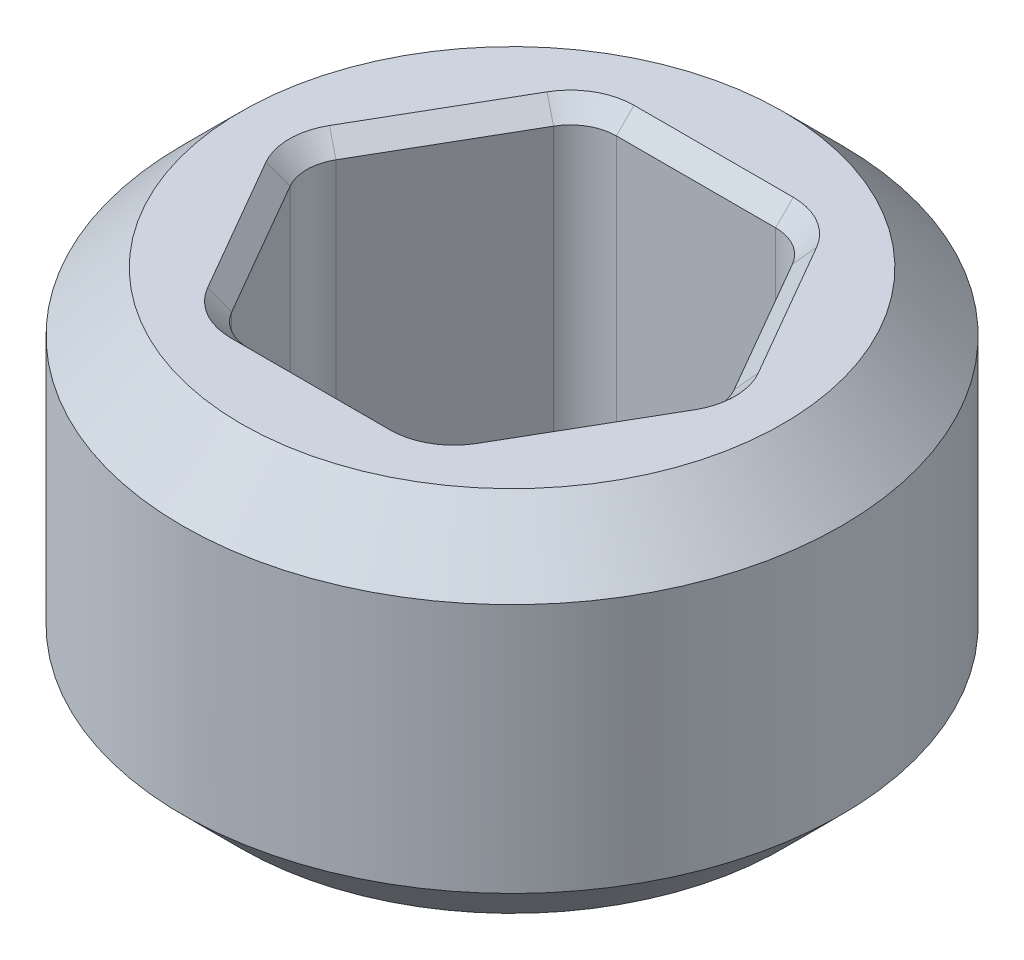
ISO-10303-21;
HEADER;
FILE_DESCRIPTION(('STEP AP214'),'2;1');
FILE_NAME('part.step','',(''),(''),'','','');
FILE_SCHEMA(('AUTOMOTIVE_DESIGN { 1 0 10303 214 1 1 1 1 }'));
ENDSEC;
DATA;
#1=APPLICATION_CONTEXT('core data for automotive mechanical design processes');
#2=APPLICATION_PROTOCOL_DEFINITION('international standard','automotive_design',2000,#1);
#3=PRODUCT_CONTEXT('',#1,'mechanical');
#4=PRODUCT('Part','Part','',(#3));
#5=PRODUCT_RELATED_PRODUCT_CATEGORY('part','',(#4));
#6=PRODUCT_DEFINITION_FORMATION('','',#4);
#7=PRODUCT_DEFINITION_CONTEXT('part definition',#1,'design');
#8=PRODUCT_DEFINITION('design','',#6,#7);
#9=PRODUCT_DEFINITION_SHAPE('','',#8);
#10=(LENGTH_UNIT() NAMED_UNIT(*) SI_UNIT(.MILLI.,.METRE.));
#11=(NAMED_UNIT(*) PLANE_ANGLE_UNIT() SI_UNIT($,.RADIAN.));
#12=(NAMED_UNIT(*) SI_UNIT($,.STERADIAN.) SOLID_ANGLE_UNIT());
#13=UNCERTAINTY_MEASURE_WITH_UNIT(LENGTH_MEASURE(1.E-05),#10,'distance_accuracy_value','');
#14=(GEOMETRIC_REPRESENTATION_CONTEXT(3) GLOBAL_UNCERTAINTY_ASSIGNED_CONTEXT((#13)) GLOBAL_UNIT_ASSIGNED_CONTEXT((#10,
#11,#12)) REPRESENTATION_CONTEXT('',''));
#15=CARTESIAN_POINT('',(0.,0.,0.));
#16=DIRECTION('',(0.,0.,1.));
#17=DIRECTION('',(1.,0.,0.));
#18=AXIS2_PLACEMENT_3D('',#15,#16,#17);
#19=CARTESIAN_POINT('',(0.,-0.79375,0.));
#20=DIRECTION('',(0.,-1.,0.));
#21=DIRECTION('',(0.,0.,-1.));
#22=AXIS2_PLACEMENT_3D('',#19,#20,#21);
#23=PLANE('',#22);
#24=CARTESIAN_POINT('',(0.343703832126949,-0.79375,0.5953125));
#25=DIRECTION('',(0.,-1.,0.));
#26=DIRECTION('',(0.,0.,-1.));
#27=AXIS2_PLACEMENT_3D('',#24,#25,#26);
#28=CIRCLE('',#27,0.2746375);
#29=CARTESIAN_POINT('',(0.343703832126949,-0.79375,0.86995));
#30=VERTEX_POINT('',#29);
#31=CARTESIAN_POINT('',(0.581546883958798,-0.79375,0.73263125));
#32=VERTEX_POINT('',#31);
#33=EDGE_CURVE('E430',#30,#32,#28,.F.);
#34=ORIENTED_EDGE('',*,*,#33,.T.);
#35=DIRECTION('',(0.499999999999999,0.,-0.866025403784439));
#36=VECTOR('',#35,1.);
#37=CARTESIAN_POINT('',(0.925250716085747,-0.79375,0.137318749999999));
#38=LINE('',#37,#36);
#39=CARTESIAN_POINT('',(0.925250716085747,-0.79375,0.137318749999999));
#40=VERTEX_POINT('',#39);
#41=EDGE_CURVE('E434',#32,#40,#38,.T.);
#42=ORIENTED_EDGE('',*,*,#41,.T.);
#43=CARTESIAN_POINT('',(0.687407664253898,-0.79375,0.));
#44=DIRECTION('',(0.,-1.,0.));
#45=DIRECTION('',(0.,0.,-1.));
#46=AXIS2_PLACEMENT_3D('',#43,#44,#45);
#47=CIRCLE('',#46,0.2746375);
#48=CARTESIAN_POINT('',(0.925250716085747,-0.79375,-0.137318750000001));
#49=VERTEX_POINT('',#48);
#50=EDGE_CURVE('E432',#40,#49,#47,.F.);
#51=ORIENTED_EDGE('',*,*,#50,.T.);
#52=DIRECTION('',(-0.5,0.,-0.866025403784439));
#53=VECTOR('',#52,1.);
#54=CARTESIAN_POINT('',(0.581546883958798,-0.79375,-0.73263125));
#55=LINE('',#54,#53);
#56=CARTESIAN_POINT('',(0.581546883958798,-0.79375,-0.73263125));
#57=VERTEX_POINT('',#56);
#58=EDGE_CURVE('E428',#49,#57,#55,.T.);
#59=ORIENTED_EDGE('',*,*,#58,.T.);
#60=CARTESIAN_POINT('',(0.343703832126949,-0.79375,-0.5953125));
#61=DIRECTION('',(0.,-1.,0.));
#62=DIRECTION('',(0.,0.,-1.));
#63=AXIS2_PLACEMENT_3D('',#60,#61,#62);
#64=CIRCLE('',#63,0.2746375);
#65=CARTESIAN_POINT('',(0.343703832126949,-0.79375,-0.86995));
#66=VERTEX_POINT('',#65);
#67=EDGE_CURVE('E420',#57,#66,#64,.F.);
#68=ORIENTED_EDGE('',*,*,#67,.T.);
#69=DIRECTION('',(-1.,0.,0.));
#70=VECTOR('',#69,1.);
#71=CARTESIAN_POINT('',(-0.343703832126949,-0.79375,-0.86995));
#72=LINE('',#71,#70);
#73=CARTESIAN_POINT('',(-0.343703832126949,-0.79375,-0.86995));
#74=VERTEX_POINT('',#73);
#75=EDGE_CURVE('E202',#66,#74,#72,.T.);
#76=ORIENTED_EDGE('',*,*,#75,.T.);
#77=CARTESIAN_POINT('',(-0.343703832126949,-0.79375,-0.5953125));
#78=DIRECTION('',(0.,-1.,0.));
#79=DIRECTION('',(0.,0.,-1.));
#80=AXIS2_PLACEMENT_3D('',#77,#78,#79);
#81=CIRCLE('',#80,0.2746375);
#82=CARTESIAN_POINT('',(-0.581546883958798,-0.79375,-0.73263125));
#83=VERTEX_POINT('',#82);
#84=EDGE_CURVE('E196',#74,#83,#81,.F.);
#85=ORIENTED_EDGE('',*,*,#84,.T.);
#86=DIRECTION('',(-0.499999999999999,0.,0.866025403784439));
#87=VECTOR('',#86,1.);
#88=CARTESIAN_POINT('',(-0.925250716085747,-0.79375,-0.137318749999999));
#89=LINE('',#88,#87);
#90=CARTESIAN_POINT('',(-0.925250716085747,-0.79375,-0.137318749999999));
#91=VERTEX_POINT('',#90);
#92=EDGE_CURVE('E199',#83,#91,#89,.T.);
#93=ORIENTED_EDGE('',*,*,#92,.T.);
#94=CARTESIAN_POINT('',(-0.687407664253898,-0.79375,0.));
#95=DIRECTION('',(0.,-1.,0.));
#96=DIRECTION('',(0.,0.,-1.));
#97=AXIS2_PLACEMENT_3D('',#94,#95,#96);
#98=CIRCLE('',#97,0.2746375);
#99=CARTESIAN_POINT('',(-0.925250716085747,-0.79375,0.137318750000001));
#100=VERTEX_POINT('',#99);
#101=EDGE_CURVE('E208',#91,#100,#98,.F.);
#102=ORIENTED_EDGE('',*,*,#101,.T.);
#103=DIRECTION('',(0.500000000000001,0.,0.866025403784438));
#104=VECTOR('',#103,1.);
#105=CARTESIAN_POINT('',(-0.581546883958797,-0.79375,0.732631250000001));
#106=LINE('',#105,#104);
#107=CARTESIAN_POINT('',(-0.581546883958797,-0.79375,0.73263125));
#108=VERTEX_POINT('',#107);
#109=EDGE_CURVE('E207',#100,#108,#106,.T.);
#110=ORIENTED_EDGE('',*,*,#109,.T.);
#111=CARTESIAN_POINT('',(-0.343703832126948,-0.79375,0.5953125));
#112=DIRECTION('',(0.,-1.,0.));
#113=DIRECTION('',(0.,0.,-1.));
#114=AXIS2_PLACEMENT_3D('',#111,#112,#113);
#115=CIRCLE('',#114,0.2746375);
#116=CARTESIAN_POINT('',(-0.343703832126948,-0.79375,0.86995));
#117=VERTEX_POINT('',#116);
#118=EDGE_CURVE('E418',#108,#117,#115,.F.);
#119=ORIENTED_EDGE('',*,*,#118,.T.);
#120=DIRECTION('',(1.,0.,0.));
#121=VECTOR('',#120,1.);
#122=CARTESIAN_POINT('',(0.343703832126949,-0.79375,0.86995));
#123=LINE('',#122,#121);
#124=EDGE_CURVE('E422',#117,#30,#123,.T.);
#125=ORIENTED_EDGE('',*,*,#124,.T.);
#126=EDGE_LOOP('',(#34,#42,#51,#59,#68,#76,#85,#93,#102,#110,#119,#125));
#127=FACE_BOUND('',#126,.T.);
#128=CARTESIAN_POINT('',(0.,-0.79375,0.));
#129=DIRECTION('',(0.,-1.,0.));
#130=DIRECTION('',(0.,0.,-1.));
#131=AXIS2_PLACEMENT_3D('',#128,#129,#130);
#132=CIRCLE('',#131,1.1684);
#133=CARTESIAN_POINT('',(0.,-0.79375,-1.1684));
#134=VERTEX_POINT('',#133);
#135=EDGE_CURVE('E464',#134,#134,#132,.T.);
#136=ORIENTED_EDGE('',*,*,#135,.T.);
#137=EDGE_LOOP('',(#136));
#138=FACE_BOUND('',#137,.T.);
#139=ADVANCED_FACE('F34',(#127,#138),#23,.T.);
#140=CARTESIAN_POINT('',(0.,-1.70416602917091,0.));
#141=DIRECTION('',(0.,-1.,0.));
#142=DIRECTION('',(0.,0.,-1.));
#143=AXIS2_PLACEMENT_3D('',#140,#141,#142);
#144=CYLINDRICAL_SURFACE('',#143,1.4224);
#145=CARTESIAN_POINT('',(0.,-0.539749999999999,0.));
#146=DIRECTION('',(0.,-1.,0.));
#147=DIRECTION('',(0.,0.,-1.));
#148=AXIS2_PLACEMENT_3D('',#145,#146,#147);
#149=CIRCLE('',#148,1.4224);
#150=CARTESIAN_POINT('',(0.,-0.539749999999999,-1.4224));
#151=VERTEX_POINT('',#150);
#152=EDGE_CURVE('E470',#151,#151,#149,.F.);
#153=ORIENTED_EDGE('',*,*,#152,.T.);
#154=EDGE_LOOP('',(#153));
#155=FACE_BOUND('',#154,.T.);
#156=CARTESIAN_POINT('',(0.,0.53975,0.));
#157=DIRECTION('',(0.,1.,0.));
#158=DIRECTION('',(0.,0.,1.));
#159=AXIS2_PLACEMENT_3D('',#156,#157,#158);
#160=CIRCLE('',#159,1.4224);
#161=CARTESIAN_POINT('',(0.,0.53975,1.4224));
#162=VERTEX_POINT('',#161);
#163=EDGE_CURVE('E467',#162,#162,#160,.F.);
#164=ORIENTED_EDGE('',*,*,#163,.T.);
#165=EDGE_LOOP('',(#164));
#166=FACE_BOUND('',#165,.T.);
#167=ADVANCED_FACE('F553',(#155,#166),#144,.T.);
#168=CARTESIAN_POINT('',(1.4224,0.79375,0.));
#169=DIRECTION('',(0.,1.,0.));
#170=DIRECTION('',(0.,0.,1.));
#171=AXIS2_PLACEMENT_3D('',#168,#169,#170);
#172=PLANE('',#171);
#173=CARTESIAN_POINT('',(0.343703832126949,0.79375,-0.5953125));
#174=DIRECTION('',(0.,1.,0.));
#175=DIRECTION('',(0.,0.,1.));
#176=AXIS2_PLACEMENT_3D('',#173,#174,#175);
#177=CIRCLE('',#176,0.2746375);
#178=CARTESIAN_POINT('',(0.343703832126949,0.79375,-0.86995));
#179=VERTEX_POINT('',#178);
#180=CARTESIAN_POINT('',(0.581546883958798,0.79375,-0.73263125));
#181=VERTEX_POINT('',#180);
#182=EDGE_CURVE('E43',#179,#181,#177,.F.);
#183=ORIENTED_EDGE('',*,*,#182,.T.);
#184=DIRECTION('',(0.5,0.,0.866025403784439));
#185=VECTOR('',#184,1.);
#186=CARTESIAN_POINT('',(0.925250716085747,0.79375,-0.137318750000001));
#187=LINE('',#186,#185);
#188=CARTESIAN_POINT('',(0.925250716085747,0.79375,-0.137318750000001));
#189=VERTEX_POINT('',#188);
#190=EDGE_CURVE('E11',#181,#189,#187,.T.);
#191=ORIENTED_EDGE('',*,*,#190,.T.);
#192=CARTESIAN_POINT('',(0.687407664253898,0.79375,0.));
#193=DIRECTION('',(0.,1.,0.));
#194=DIRECTION('',(0.,0.,1.));
#195=AXIS2_PLACEMENT_3D('',#192,#193,#194);
#196=CIRCLE('',#195,0.2746375);
#197=CARTESIAN_POINT('',(0.925250716085747,0.79375,0.137318749999999));
#198=VERTEX_POINT('',#197);
#199=EDGE_CURVE('E346',#189,#198,#196,.F.);
#200=ORIENTED_EDGE('',*,*,#199,.T.);
#201=DIRECTION('',(-0.499999999999999,0.,0.866025403784439));
#202=VECTOR('',#201,1.);
#203=CARTESIAN_POINT('',(0.581546883958798,0.79375,0.73263125));
#204=LINE('',#203,#202);
#205=CARTESIAN_POINT('',(0.581546883958798,0.79375,0.73263125));
#206=VERTEX_POINT('',#205);
#207=EDGE_CURVE('E342',#198,#206,#204,.T.);
#208=ORIENTED_EDGE('',*,*,#207,.T.);
#209=CARTESIAN_POINT('',(0.343703832126949,0.79375,0.5953125));
#210=DIRECTION('',(0.,1.,0.));
#211=DIRECTION('',(0.,0.,1.));
#212=AXIS2_PLACEMENT_3D('',#209,#210,#211);
#213=CIRCLE('',#212,0.2746375);
#214=CARTESIAN_POINT('',(0.343703832126949,0.79375,0.86995));
#215=VERTEX_POINT('',#214);
#216=EDGE_CURVE('E338',#206,#215,#213,.F.);
#217=ORIENTED_EDGE('',*,*,#216,.T.);
#218=DIRECTION('',(-1.,0.,0.));
#219=VECTOR('',#218,1.);
#220=CARTESIAN_POINT('',(-0.343703832126948,0.79375,0.86995));
#221=LINE('',#220,#219);
#222=CARTESIAN_POINT('',(-0.343703832126948,0.79375,0.86995));
#223=VERTEX_POINT('',#222);
#224=EDGE_CURVE('E334',#215,#223,#221,.T.);
#225=ORIENTED_EDGE('',*,*,#224,.T.);
#226=CARTESIAN_POINT('',(-0.343703832126948,0.79375,0.5953125));
#227=DIRECTION('',(0.,1.,0.));
#228=DIRECTION('',(0.,0.,1.));
#229=AXIS2_PLACEMENT_3D('',#226,#227,#228);
#230=CIRCLE('',#229,0.2746375);
#231=CARTESIAN_POINT('',(-0.581546883958798,0.79375,0.73263125));
#232=VERTEX_POINT('',#231);
#233=EDGE_CURVE('E330',#223,#232,#230,.F.);
#234=ORIENTED_EDGE('',*,*,#233,.T.);
#235=DIRECTION('',(-0.500000000000001,0.,-0.866025403784438));
#236=VECTOR('',#235,1.);
#237=CARTESIAN_POINT('',(-0.925250716085747,0.79375,0.137318750000001));
#238=LINE('',#237,#236);
#239=CARTESIAN_POINT('',(-0.925250716085747,0.79375,0.137318750000001));
#240=VERTEX_POINT('',#239);
#241=EDGE_CURVE('E328',#232,#240,#238,.T.);
#242=ORIENTED_EDGE('',*,*,#241,.T.);
#243=CARTESIAN_POINT('',(-0.687407664253898,0.79375,0.));
#244=DIRECTION('',(0.,1.,0.));
#245=DIRECTION('',(0.,0.,1.));
#246=AXIS2_PLACEMENT_3D('',#243,#244,#245);
#247=CIRCLE('',#246,0.2746375);
#248=CARTESIAN_POINT('',(-0.925250716085747,0.79375,-0.13731875));
#249=VERTEX_POINT('',#248);
#250=EDGE_CURVE('E332',#240,#249,#247,.F.);
#251=ORIENTED_EDGE('',*,*,#250,.T.);
#252=DIRECTION('',(0.499999999999999,0.,-0.866025403784439));
#253=VECTOR('',#252,1.);
#254=CARTESIAN_POINT('',(-0.581546883958799,0.79375,-0.73263125));
#255=LINE('',#254,#253);
#256=CARTESIAN_POINT('',(-0.581546883958799,0.79375,-0.73263125));
#257=VERTEX_POINT('',#256);
#258=EDGE_CURVE('E336',#249,#257,#255,.T.);
#259=ORIENTED_EDGE('',*,*,#258,.T.);
#260=CARTESIAN_POINT('',(-0.343703832126949,0.79375,-0.5953125));
#261=DIRECTION('',(0.,1.,0.));
#262=DIRECTION('',(0.,0.,1.));
#263=AXIS2_PLACEMENT_3D('',#260,#261,#262);
#264=CIRCLE('',#263,0.2746375);
#265=CARTESIAN_POINT('',(-0.343703832126949,0.79375,-0.86995));
#266=VERTEX_POINT('',#265);
#267=EDGE_CURVE('E340',#257,#266,#264,.F.);
#268=ORIENTED_EDGE('',*,*,#267,.T.);
#269=DIRECTION('',(1.,0.,0.));
#270=VECTOR('',#269,1.);
#271=CARTESIAN_POINT('',(0.343703832126949,0.79375,-0.86995));
#272=LINE('',#271,#270);
#273=EDGE_CURVE('E344',#266,#179,#272,.T.);
#274=ORIENTED_EDGE('',*,*,#273,.T.);
#275=EDGE_LOOP('',(#183,#191,#200,#208,#217,#225,#234,#242,#251,#259,#268,#274));
#276=FACE_BOUND('',#275,.T.);
#277=CARTESIAN_POINT('',(0.,0.79375,0.));
#278=DIRECTION('',(0.,1.,0.));
#279=DIRECTION('',(0.,0.,1.));
#280=AXIS2_PLACEMENT_3D('',#277,#278,#279);
#281=CIRCLE('',#280,1.1684);
#282=CARTESIAN_POINT('',(0.,0.79375,1.1684));
#283=VERTEX_POINT('',#282);
#284=EDGE_CURVE('E219',#283,#283,#281,.T.);
#285=ORIENTED_EDGE('',*,*,#284,.T.);
#286=EDGE_LOOP('',(#285));
#287=FACE_BOUND('',#286,.T.);
#288=ADVANCED_FACE('F348',(#276,#287),#172,.T.);
#289=CARTESIAN_POINT('',(0.91654355233853,-0.79375,0.));
#290=DIRECTION('',(0.866025403784438,0.,-0.5));
#291=DIRECTION('',(-0.5,0.,-0.866025403784439));
#292=AXIS2_PLACEMENT_3D('',#289,#290,#291);
#293=PLANE('',#292);
#294=DIRECTION('',(0.,1.,0.));
#295=VECTOR('',#294,1.);
#296=CARTESIAN_POINT('',(0.515555748190423,-0.79375,-0.69453125));
#297=LINE('',#296,#295);
#298=CARTESIAN_POINT('',(0.515555748190423,0.71755,-0.69453125));
#299=VERTEX_POINT('',#298);
#300=CARTESIAN_POINT('',(0.515555748190423,-0.71755,-0.69453125));
#301=VERTEX_POINT('',#300);
#302=EDGE_CURVE('E225',#299,#301,#297,.F.);
#303=ORIENTED_EDGE('',*,*,#302,.T.);
#304=DIRECTION('',(0.5,0.,0.866025403784439));
#305=VECTOR('',#304,1.);
#306=CARTESIAN_POINT('',(0.859259580317372,-0.71755,-0.0992187500000007));
#307=LINE('',#306,#305);
#308=CARTESIAN_POINT('',(0.859259580317372,-0.71755,-0.0992187500000007));
#309=VERTEX_POINT('',#308);
#310=EDGE_CURVE('E380',#301,#309,#307,.T.);
#311=ORIENTED_EDGE('',*,*,#310,.T.);
#312=DIRECTION('',(0.,1.,0.));
#313=VECTOR('',#312,1.);
#314=CARTESIAN_POINT('',(0.859259580317372,0.79375,-0.0992187500000007));
#315=LINE('',#314,#313);
#316=CARTESIAN_POINT('',(0.859259580317372,0.71755,-0.0992187500000007));
#317=VERTEX_POINT('',#316);
#318=EDGE_CURVE('E448',#309,#317,#315,.T.);
#319=ORIENTED_EDGE('',*,*,#318,.T.);
#320=DIRECTION('',(-0.5,0.,-0.866025403784439));
#321=VECTOR('',#320,1.);
#322=CARTESIAN_POINT('',(0.515555748190423,0.71755,-0.69453125));
#323=LINE('',#322,#321);
#324=EDGE_CURVE('E377',#317,#299,#323,.T.);
#325=ORIENTED_EDGE('',*,*,#324,.T.);
#326=EDGE_LOOP('',(#303,#311,#319,#325));
#327=FACE_BOUND('',#326,.T.);
#328=ADVANCED_FACE('F532',(#327),#293,.F.);
#329=CARTESIAN_POINT('',(0.458271776169266,-0.79375,0.79375));
#330=DIRECTION('',(0.866025403784439,0.,0.499999999999999));
#331=DIRECTION('',(0.499999999999999,0.,-0.866025403784439));
#332=AXIS2_PLACEMENT_3D('',#329,#330,#331);
#333=PLANE('',#332);
#334=DIRECTION('',(0.,1.,0.));
#335=VECTOR('',#334,1.);
#336=CARTESIAN_POINT('',(0.859259580317372,-0.79375,0.0992187499999992));
#337=LINE('',#336,#335);
#338=CARTESIAN_POINT('',(0.859259580317372,0.71755,0.0992187499999992));
#339=VERTEX_POINT('',#338);
#340=CARTESIAN_POINT('',(0.859259580317372,-0.71755,0.0992187499999992));
#341=VERTEX_POINT('',#340);
#342=EDGE_CURVE('E440',#339,#341,#337,.F.);
#343=ORIENTED_EDGE('',*,*,#342,.T.);
#344=DIRECTION('',(-0.499999999999999,0.,0.866025403784439));
#345=VECTOR('',#344,1.);
#346=CARTESIAN_POINT('',(0.515555748190424,-0.71755,0.69453125));
#347=LINE('',#346,#345);
#348=CARTESIAN_POINT('',(0.515555748190424,-0.71755,0.69453125));
#349=VERTEX_POINT('',#348);
#350=EDGE_CURVE('E365',#341,#349,#347,.T.);
#351=ORIENTED_EDGE('',*,*,#350,.T.);
#352=DIRECTION('',(0.,1.,0.));
#353=VECTOR('',#352,1.);
#354=CARTESIAN_POINT('',(0.515555748190424,0.79375,0.69453125));
#355=LINE('',#354,#353);
#356=CARTESIAN_POINT('',(0.515555748190424,0.71755,0.69453125));
#357=VERTEX_POINT('',#356);
#358=EDGE_CURVE('E442',#349,#357,#355,.T.);
#359=ORIENTED_EDGE('',*,*,#358,.T.);
#360=DIRECTION('',(0.499999999999999,0.,-0.866025403784439));
#361=VECTOR('',#360,1.);
#362=CARTESIAN_POINT('',(0.859259580317372,0.71755,0.0992187499999991));
#363=LINE('',#362,#361);
#364=EDGE_CURVE('E370',#357,#339,#363,.T.);
#365=ORIENTED_EDGE('',*,*,#364,.T.);
#366=EDGE_LOOP('',(#343,#351,#359,#365));
#367=FACE_BOUND('',#366,.T.);
#368=ADVANCED_FACE('F439',(#367),#333,.F.);
#369=CARTESIAN_POINT('',(-0.458271776169265,-0.79375,0.79375));
#370=DIRECTION('',(0.,0.,1.));
#371=DIRECTION('',(1.,0.,0.));
#372=AXIS2_PLACEMENT_3D('',#369,#370,#371);
#373=PLANE('',#372);
#374=DIRECTION('',(0.,1.,0.));
#375=VECTOR('',#374,1.);
#376=CARTESIAN_POINT('',(0.343703832126949,-0.79375,0.79375));
#377=LINE('',#376,#375);
#378=CARTESIAN_POINT('',(0.343703832126949,0.71755,0.79375));
#379=VERTEX_POINT('',#378);
#380=CARTESIAN_POINT('',(0.343703832126949,-0.71755,0.79375));
#381=VERTEX_POINT('',#380);
#382=EDGE_CURVE('E446',#379,#381,#377,.F.);
#383=ORIENTED_EDGE('',*,*,#382,.T.);
#384=DIRECTION('',(-1.,0.,0.));
#385=VECTOR('',#384,1.);
#386=CARTESIAN_POINT('',(-0.343703832126948,-0.71755,0.79375));
#387=LINE('',#386,#385);
#388=CARTESIAN_POINT('',(-0.343703832126948,-0.71755,0.79375));
#389=VERTEX_POINT('',#388);
#390=EDGE_CURVE('E384',#381,#389,#387,.T.);
#391=ORIENTED_EDGE('',*,*,#390,.T.);
#392=DIRECTION('',(0.,1.,0.));
#393=VECTOR('',#392,1.);
#394=CARTESIAN_POINT('',(-0.343703832126948,0.79375,0.79375));
#395=LINE('',#394,#393);
#396=CARTESIAN_POINT('',(-0.343703832126948,0.71755,0.79375));
#397=VERTEX_POINT('',#396);
#398=EDGE_CURVE('E399',#389,#397,#395,.T.);
#399=ORIENTED_EDGE('',*,*,#398,.T.);
#400=DIRECTION('',(1.,0.,0.));
#401=VECTOR('',#400,1.);
#402=CARTESIAN_POINT('',(0.343703832126949,0.71755,0.79375));
#403=LINE('',#402,#401);
#404=EDGE_CURVE('E382',#397,#379,#403,.T.);
#405=ORIENTED_EDGE('',*,*,#404,.T.);
#406=EDGE_LOOP('',(#383,#391,#399,#405));
#407=FACE_BOUND('',#406,.T.);
#408=ADVANCED_FACE('F504',(#407),#373,.F.);
#409=CARTESIAN_POINT('',(-0.916543552338531,-0.79375,0.));
#410=DIRECTION('',(-0.866025403784438,0.,0.500000000000001));
#411=DIRECTION('',(0.500000000000001,0.,0.866025403784438));
#412=AXIS2_PLACEMENT_3D('',#409,#410,#411);
#413=PLANE('',#412);
#414=DIRECTION('',(0.,1.,0.));
#415=VECTOR('',#414,1.);
#416=CARTESIAN_POINT('',(-0.515555748190423,-0.79375,0.69453125));
#417=LINE('',#416,#415);
#418=CARTESIAN_POINT('',(-0.515555748190423,0.71755,0.69453125));
#419=VERTEX_POINT('',#418);
#420=CARTESIAN_POINT('',(-0.515555748190423,-0.71755,0.69453125));
#421=VERTEX_POINT('',#420);
#422=EDGE_CURVE('E397',#419,#421,#417,.F.);
#423=ORIENTED_EDGE('',*,*,#422,.T.);
#424=DIRECTION('',(-0.500000000000001,0.,-0.866025403784438));
#425=VECTOR('',#424,1.);
#426=CARTESIAN_POINT('',(-0.859259580317372,-0.71755,0.0992187500000007));
#427=LINE('',#426,#425);
#428=CARTESIAN_POINT('',(-0.859259580317372,-0.71755,0.0992187500000006));
#429=VERTEX_POINT('',#428);
#430=EDGE_CURVE('E310',#421,#429,#427,.T.);
#431=ORIENTED_EDGE('',*,*,#430,.T.);
#432=DIRECTION('',(0.,1.,0.));
#433=VECTOR('',#432,1.);
#434=CARTESIAN_POINT('',(-0.859259580317372,0.79375,0.0992187500000006));
#435=LINE('',#434,#433);
#436=CARTESIAN_POINT('',(-0.859259580317372,0.71755,0.0992187500000006));
#437=VERTEX_POINT('',#436);
#438=EDGE_CURVE('E409',#429,#437,#435,.T.);
#439=ORIENTED_EDGE('',*,*,#438,.T.);
#440=DIRECTION('',(0.500000000000001,0.,0.866025403784438));
#441=VECTOR('',#440,1.);
#442=CARTESIAN_POINT('',(-0.515555748190423,0.71755,0.69453125));
#443=LINE('',#442,#441);
#444=EDGE_CURVE('E307',#437,#419,#443,.T.);
#445=ORIENTED_EDGE('',*,*,#444,.T.);
#446=EDGE_LOOP('',(#423,#431,#439,#445));
#447=FACE_BOUND('',#446,.T.);
#448=ADVANCED_FACE('F404',(#447),#413,.F.);
#449=CARTESIAN_POINT('',(-0.458271776169266,-0.79375,-0.79375));
#450=DIRECTION('',(-0.866025403784439,0.,-0.499999999999999));
#451=DIRECTION('',(-0.499999999999999,0.,0.866025403784439));
#452=AXIS2_PLACEMENT_3D('',#449,#450,#451);
#453=PLANE('',#452);
#454=DIRECTION('',(0.,1.,0.));
#455=VECTOR('',#454,1.);
#456=CARTESIAN_POINT('',(-0.859259580317372,-0.79375,-0.0992187499999994));
#457=LINE('',#456,#455);
#458=CARTESIAN_POINT('',(-0.859259580317372,0.71755,-0.0992187499999994));
#459=VERTEX_POINT('',#458);
#460=CARTESIAN_POINT('',(-0.859259580317372,-0.71755,-0.0992187499999994));
#461=VERTEX_POINT('',#460);
#462=EDGE_CURVE('E457',#459,#461,#457,.F.);
#463=ORIENTED_EDGE('',*,*,#462,.T.);
#464=DIRECTION('',(0.499999999999999,0.,-0.866025403784439));
#465=VECTOR('',#464,1.);
#466=CARTESIAN_POINT('',(-0.515555748190424,-0.71755,-0.69453125));
#467=LINE('',#466,#465);
#468=CARTESIAN_POINT('',(-0.515555748190424,-0.71755,-0.69453125));
#469=VERTEX_POINT('',#468);
#470=EDGE_CURVE('E326',#461,#469,#467,.T.);
#471=ORIENTED_EDGE('',*,*,#470,.T.);
#472=DIRECTION('',(0.,1.,0.));
#473=VECTOR('',#472,1.);
#474=CARTESIAN_POINT('',(-0.515555748190424,0.79375,-0.69453125));
#475=LINE('',#474,#473);
#476=CARTESIAN_POINT('',(-0.515555748190424,0.71755,-0.69453125));
#477=VERTEX_POINT('',#476);
#478=EDGE_CURVE('E408',#469,#477,#475,.T.);
#479=ORIENTED_EDGE('',*,*,#478,.T.);
#480=DIRECTION('',(-0.499999999999999,0.,0.866025403784439));
#481=VECTOR('',#480,1.);
#482=CARTESIAN_POINT('',(-0.859259580317372,0.71755,-0.0992187499999993));
#483=LINE('',#482,#481);
#484=EDGE_CURVE('E324',#477,#459,#483,.T.);
#485=ORIENTED_EDGE('',*,*,#484,.T.);
#486=EDGE_LOOP('',(#463,#471,#479,#485));
#487=FACE_BOUND('',#486,.T.);
#488=ADVANCED_FACE('F482',(#487),#453,.F.);
#489=CARTESIAN_POINT('',(0.458271776169265,-0.79375,-0.79375));
#490=DIRECTION('',(0.,0.,-1.));
#491=DIRECTION('',(-1.,0.,0.));
#492=AXIS2_PLACEMENT_3D('',#489,#490,#491);
#493=PLANE('',#492);
#494=DIRECTION('',(0.,1.,0.));
#495=VECTOR('',#494,1.);
#496=CARTESIAN_POINT('',(-0.343703832126949,-0.79375,-0.79375));
#497=LINE('',#496,#495);
#498=CARTESIAN_POINT('',(-0.343703832126949,0.71755,-0.79375));
#499=VERTEX_POINT('',#498);
#500=CARTESIAN_POINT('',(-0.343703832126949,-0.71755,-0.79375));
#501=VERTEX_POINT('',#500);
#502=EDGE_CURVE('E462',#499,#501,#497,.F.);
#503=ORIENTED_EDGE('',*,*,#502,.T.);
#504=DIRECTION('',(1.,0.,0.));
#505=VECTOR('',#504,1.);
#506=CARTESIAN_POINT('',(0.343703832126949,-0.71755,-0.79375));
#507=LINE('',#506,#505);
#508=CARTESIAN_POINT('',(0.343703832126949,-0.71755,-0.79375));
#509=VERTEX_POINT('',#508);
#510=EDGE_CURVE('E301',#501,#509,#507,.T.);
#511=ORIENTED_EDGE('',*,*,#510,.T.);
#512=DIRECTION('',(0.,1.,0.));
#513=VECTOR('',#512,1.);
#514=CARTESIAN_POINT('',(0.343703832126949,0.79375,-0.79375));
#515=LINE('',#514,#513);
#516=CARTESIAN_POINT('',(0.343703832126949,0.71755,-0.79375));
#517=VERTEX_POINT('',#516);
#518=EDGE_CURVE('E460',#509,#517,#515,.T.);
#519=ORIENTED_EDGE('',*,*,#518,.T.);
#520=DIRECTION('',(-1.,0.,0.));
#521=VECTOR('',#520,1.);
#522=CARTESIAN_POINT('',(-0.343703832126949,0.71755,-0.79375));
#523=LINE('',#522,#521);
#524=EDGE_CURVE('E308',#517,#499,#523,.T.);
#525=ORIENTED_EDGE('',*,*,#524,.T.);
#526=EDGE_LOOP('',(#503,#511,#519,#525));
#527=FACE_BOUND('',#526,.T.);
#528=ADVANCED_FACE('F540',(#527),#493,.F.);
#529=CARTESIAN_POINT('',(0.687407664253898,-0.79375,0.));
#530=DIRECTION('',(0.,-1.,0.));
#531=DIRECTION('',(0.,0.,-1.));
#532=AXIS2_PLACEMENT_3D('',#529,#530,#531);
#533=CYLINDRICAL_SURFACE('',#532,0.1984375);
#534=ORIENTED_EDGE('',*,*,#318,.F.);
#535=CARTESIAN_POINT('',(0.687407664253898,-0.71755,0.));
#536=DIRECTION('',(0.,-1.,0.));
#537=DIRECTION('',(0.,0.,-1.));
#538=AXIS2_PLACEMENT_3D('',#535,#536,#537);
#539=CIRCLE('',#538,0.1984375);
#540=EDGE_CURVE('E364',#309,#341,#539,.T.);
#541=ORIENTED_EDGE('',*,*,#540,.T.);
#542=ORIENTED_EDGE('',*,*,#342,.F.);
#543=CARTESIAN_POINT('',(0.687407664253898,0.71755,0.));
#544=DIRECTION('',(0.,1.,0.));
#545=DIRECTION('',(0.,0.,1.));
#546=AXIS2_PLACEMENT_3D('',#543,#544,#545);
#547=CIRCLE('',#546,0.1984375);
#548=EDGE_CURVE('E359',#339,#317,#547,.T.);
#549=ORIENTED_EDGE('',*,*,#548,.T.);
#550=EDGE_LOOP('',(#534,#541,#542,#549));
#551=FACE_BOUND('',#550,.T.);
#552=ADVANCED_FACE('F443',(#551),#533,.F.);
#553=CARTESIAN_POINT('',(0.343703832126949,-0.79375,0.5953125));
#554=DIRECTION('',(0.,-1.,0.));
#555=DIRECTION('',(0.,0.,-1.));
#556=AXIS2_PLACEMENT_3D('',#553,#554,#555);
#557=CYLINDRICAL_SURFACE('',#556,0.1984375);
#558=ORIENTED_EDGE('',*,*,#358,.F.);
#559=CARTESIAN_POINT('',(0.343703832126949,-0.71755,0.5953125));
#560=DIRECTION('',(0.,-1.,0.));
#561=DIRECTION('',(0.,0.,-1.));
#562=AXIS2_PLACEMENT_3D('',#559,#560,#561);
#563=CIRCLE('',#562,0.1984375);
#564=EDGE_CURVE('E375',#349,#381,#563,.T.);
#565=ORIENTED_EDGE('',*,*,#564,.T.);
#566=ORIENTED_EDGE('',*,*,#382,.F.);
#567=CARTESIAN_POINT('',(0.343703832126949,0.71755,0.5953125));
#568=DIRECTION('',(0.,1.,0.));
#569=DIRECTION('',(0.,0.,1.));
#570=AXIS2_PLACEMENT_3D('',#567,#568,#569);
#571=CIRCLE('',#570,0.1984375);
#572=EDGE_CURVE('E367',#379,#357,#571,.T.);
#573=ORIENTED_EDGE('',*,*,#572,.T.);
#574=EDGE_LOOP('',(#558,#565,#566,#573));
#575=FACE_BOUND('',#574,.T.);
#576=ADVANCED_FACE('F564',(#575),#557,.F.);
#577=CARTESIAN_POINT('',(-0.343703832126948,-0.79375,0.5953125));
#578=DIRECTION('',(0.,-1.,0.));
#579=DIRECTION('',(0.,0.,-1.));
#580=AXIS2_PLACEMENT_3D('',#577,#578,#579);
#581=CYLINDRICAL_SURFACE('',#580,0.1984375);
#582=ORIENTED_EDGE('',*,*,#398,.F.);
#583=CARTESIAN_POINT('',(-0.343703832126948,-0.71755,0.5953125));
#584=DIRECTION('',(0.,-1.,0.));
#585=DIRECTION('',(0.,0.,-1.));
#586=AXIS2_PLACEMENT_3D('',#583,#584,#585);
#587=CIRCLE('',#586,0.1984375);
#588=EDGE_CURVE('E312',#389,#421,#587,.T.);
#589=ORIENTED_EDGE('',*,*,#588,.T.);
#590=ORIENTED_EDGE('',*,*,#422,.F.);
#591=CARTESIAN_POINT('',(-0.343703832126948,0.71755,0.5953125));
#592=DIRECTION('',(0.,1.,0.));
#593=DIRECTION('',(0.,0.,1.));
#594=AXIS2_PLACEMENT_3D('',#591,#592,#593);
#595=CIRCLE('',#594,0.1984375);
#596=EDGE_CURVE('E390',#419,#397,#595,.T.);
#597=ORIENTED_EDGE('',*,*,#596,.T.);
#598=EDGE_LOOP('',(#582,#589,#590,#597));
#599=FACE_BOUND('',#598,.T.);
#600=ADVANCED_FACE('F396',(#599),#581,.F.);
#601=CARTESIAN_POINT('',(-0.687407664253898,-0.79375,0.));
#602=DIRECTION('',(0.,-1.,0.));
#603=DIRECTION('',(0.,0.,-1.));
#604=AXIS2_PLACEMENT_3D('',#601,#602,#603);
#605=CYLINDRICAL_SURFACE('',#604,0.1984375);
#606=ORIENTED_EDGE('',*,*,#438,.F.);
#607=CARTESIAN_POINT('',(-0.687407664253898,-0.71755,0.));
#608=DIRECTION('',(0.,-1.,0.));
#609=DIRECTION('',(0.,0.,-1.));
#610=AXIS2_PLACEMENT_3D('',#607,#608,#609);
#611=CIRCLE('',#610,0.1984375);
#612=EDGE_CURVE('E322',#429,#461,#611,.T.);
#613=ORIENTED_EDGE('',*,*,#612,.T.);
#614=ORIENTED_EDGE('',*,*,#462,.F.);
#615=CARTESIAN_POINT('',(-0.687407664253898,0.71755,0.));
#616=DIRECTION('',(0.,1.,0.));
#617=DIRECTION('',(0.,0.,1.));
#618=AXIS2_PLACEMENT_3D('',#615,#616,#617);
#619=CIRCLE('',#618,0.1984375);
#620=EDGE_CURVE('E320',#459,#437,#619,.T.);
#621=ORIENTED_EDGE('',*,*,#620,.T.);
#622=EDGE_LOOP('',(#606,#613,#614,#621));
#623=FACE_BOUND('',#622,.T.);
#624=ADVANCED_FACE('F480',(#623),#605,.F.);
#625=CARTESIAN_POINT('',(-0.343703832126949,-0.79375,-0.5953125));
#626=DIRECTION('',(0.,-1.,0.));
#627=DIRECTION('',(0.,0.,-1.));
#628=AXIS2_PLACEMENT_3D('',#625,#626,#627);
#629=CYLINDRICAL_SURFACE('',#628,0.1984375);
#630=ORIENTED_EDGE('',*,*,#478,.F.);
#631=CARTESIAN_POINT('',(-0.343703832126949,-0.71755,-0.5953125));
#632=DIRECTION('',(0.,-1.,0.));
#633=DIRECTION('',(0.,0.,-1.));
#634=AXIS2_PLACEMENT_3D('',#631,#632,#633);
#635=CIRCLE('',#634,0.1984375);
#636=EDGE_CURVE('E222',#469,#501,#635,.T.);
#637=ORIENTED_EDGE('',*,*,#636,.T.);
#638=ORIENTED_EDGE('',*,*,#502,.F.);
#639=CARTESIAN_POINT('',(-0.343703832126949,0.71755,-0.5953125));
#640=DIRECTION('',(0.,1.,0.));
#641=DIRECTION('',(0.,0.,1.));
#642=AXIS2_PLACEMENT_3D('',#639,#640,#641);
#643=CIRCLE('',#642,0.1984375);
#644=EDGE_CURVE('E317',#499,#477,#643,.T.);
#645=ORIENTED_EDGE('',*,*,#644,.T.);
#646=EDGE_LOOP('',(#630,#637,#638,#645));
#647=FACE_BOUND('',#646,.T.);
#648=ADVANCED_FACE('F572',(#647),#629,.F.);
#649=CARTESIAN_POINT('',(0.343703832126949,-0.79375,-0.5953125));
#650=DIRECTION('',(0.,-1.,0.));
#651=DIRECTION('',(0.,0.,-1.));
#652=AXIS2_PLACEMENT_3D('',#649,#650,#651);
#653=CYLINDRICAL_SURFACE('',#652,0.1984375);
#654=ORIENTED_EDGE('',*,*,#518,.F.);
#655=CARTESIAN_POINT('',(0.343703832126949,-0.71755,-0.5953125));
#656=DIRECTION('',(0.,-1.,0.));
#657=DIRECTION('',(0.,0.,-1.));
#658=AXIS2_PLACEMENT_3D('',#655,#656,#657);
#659=CIRCLE('',#658,0.1984375);
#660=EDGE_CURVE('E388',#509,#301,#659,.T.);
#661=ORIENTED_EDGE('',*,*,#660,.T.);
#662=ORIENTED_EDGE('',*,*,#302,.F.);
#663=CARTESIAN_POINT('',(0.343703832126949,0.71755,-0.5953125));
#664=DIRECTION('',(0.,1.,0.));
#665=DIRECTION('',(0.,0.,1.));
#666=AXIS2_PLACEMENT_3D('',#663,#664,#665);
#667=CIRCLE('',#666,0.1984375);
#668=EDGE_CURVE('E386',#299,#517,#667,.T.);
#669=ORIENTED_EDGE('',*,*,#668,.T.);
#670=EDGE_LOOP('',(#654,#661,#662,#669));
#671=FACE_BOUND('',#670,.T.);
#672=ADVANCED_FACE('F530',(#671),#653,.F.);
#673=CARTESIAN_POINT('',(0.,-0.79375,0.));
#674=DIRECTION('',(0.,1.,0.));
#675=DIRECTION('',(0.,0.,1.));
#676=AXIS2_PLACEMENT_3D('',#673,#674,#675);
#677=CONICAL_SURFACE('',#676,1.1684,0.785398163397446);
#678=ORIENTED_EDGE('',*,*,#152,.F.);
#679=EDGE_LOOP('',(#678));
#680=FACE_BOUND('',#679,.T.);
#681=ORIENTED_EDGE('',*,*,#135,.F.);
#682=EDGE_LOOP('',(#681));
#683=FACE_BOUND('',#682,.T.);
#684=ADVANCED_FACE('F578',(#680,#683),#677,.T.);
#685=CARTESIAN_POINT('',(0.,0.53975,0.));
#686=DIRECTION('',(0.,-1.,0.));
#687=DIRECTION('',(0.,0.,-1.));
#688=AXIS2_PLACEMENT_3D('',#685,#686,#687);
#689=CONICAL_SURFACE('',#688,1.4224,0.78539816339745);
#690=ORIENTED_EDGE('',*,*,#284,.F.);
#691=EDGE_LOOP('',(#690));
#692=FACE_BOUND('',#691,.T.);
#693=ORIENTED_EDGE('',*,*,#163,.F.);
#694=EDGE_LOOP('',(#693));
#695=FACE_BOUND('',#694,.T.);
#696=ADVANCED_FACE('F581',(#692,#695),#689,.T.);
#697=CARTESIAN_POINT('',(-0.753398800022272,-0.79375,-0.434975000000001));
#698=DIRECTION('',(0.612372435695795,-0.707106781186547,0.353553390593273));
#699=DIRECTION('',(0.499999999999999,0.,-0.866025403784439));
#700=AXIS2_PLACEMENT_3D('',#697,#698,#699);
#701=PLANE('',#700);
#702=DIRECTION('',(-0.612372435695795,-0.707106781186548,-0.353553390593273));
#703=VECTOR('',#702,1.);
#704=CARTESIAN_POINT('',(-0.515555748190424,-0.71755,-0.69453125));
#705=LINE('',#704,#703);
#706=EDGE_CURVE('E214',#469,#83,#705,.T.);
#707=ORIENTED_EDGE('',*,*,#706,.F.);
#708=ORIENTED_EDGE('',*,*,#470,.F.);
#709=DIRECTION('',(0.612372435695795,0.707106781186548,0.353553390593273));
#710=VECTOR('',#709,1.);
#711=CARTESIAN_POINT('',(-0.925250716085747,-0.79375,-0.137318749999999));
#712=LINE('',#711,#710);
#713=EDGE_CURVE('E217',#91,#461,#712,.T.);
#714=ORIENTED_EDGE('',*,*,#713,.F.);
#715=ORIENTED_EDGE('',*,*,#92,.F.);
#716=EDGE_LOOP('',(#707,#708,#714,#715));
#717=FACE_BOUND('',#716,.T.);
#718=ADVANCED_FACE('F212',(#717),#701,.T.);
#719=CARTESIAN_POINT('',(-0.687407664253898,-0.79375,0.));
#720=DIRECTION('',(0.,-1.,0.));
#721=DIRECTION('',(0.,0.,-1.));
#722=AXIS2_PLACEMENT_3D('',#719,#720,#721);
#723=CONICAL_SURFACE('',#722,0.2746375,0.785398163397448);
#724=ORIENTED_EDGE('',*,*,#713,.T.);
#725=ORIENTED_EDGE('',*,*,#612,.F.);
#726=DIRECTION('',(0.612372435695794,0.707106781186548,-0.353553390593274));
#727=VECTOR('',#726,1.);
#728=CARTESIAN_POINT('',(-0.925250716085747,-0.79375,0.137318750000001));
#729=LINE('',#728,#727);
#730=EDGE_CURVE('E223',#100,#429,#729,.T.);
#731=ORIENTED_EDGE('',*,*,#730,.F.);
#732=ORIENTED_EDGE('',*,*,#101,.F.);
#733=EDGE_LOOP('',(#724,#725,#731,#732));
#734=FACE_BOUND('',#733,.T.);
#735=ADVANCED_FACE('F477',(#734),#723,.F.);
#736=CARTESIAN_POINT('',(-0.343703832126949,-0.79375,-0.5953125));
#737=DIRECTION('',(0.,-1.,0.));
#738=DIRECTION('',(0.,0.,-1.));
#739=AXIS2_PLACEMENT_3D('',#736,#737,#738);
#740=CONICAL_SURFACE('',#739,0.2746375,0.785398163397448);
#741=ORIENTED_EDGE('',*,*,#706,.T.);
#742=ORIENTED_EDGE('',*,*,#84,.F.);
#743=DIRECTION('',(0.,-0.707106781186547,-0.707106781186547));
#744=VECTOR('',#743,1.);
#745=CARTESIAN_POINT('',(-0.343703832126949,-0.71755,-0.79375));
#746=LINE('',#745,#744);
#747=EDGE_CURVE('E228',#501,#74,#746,.T.);
#748=ORIENTED_EDGE('',*,*,#747,.F.);
#749=ORIENTED_EDGE('',*,*,#636,.F.);
#750=EDGE_LOOP('',(#741,#742,#748,#749));
#751=FACE_BOUND('',#750,.T.);
#752=ADVANCED_FACE('F221',(#751),#740,.F.);
#753=CARTESIAN_POINT('',(-0.753398800022271,-0.79375,0.434975000000002));
#754=DIRECTION('',(0.612372435695795,-0.707106781186547,-0.353553390593274));
#755=DIRECTION('',(-0.500000000000001,0.,-0.866025403784438));
#756=AXIS2_PLACEMENT_3D('',#753,#754,#755);
#757=PLANE('',#756);
#758=ORIENTED_EDGE('',*,*,#730,.T.);
#759=ORIENTED_EDGE('',*,*,#430,.F.);
#760=DIRECTION('',(0.612372435695795,0.707106781186547,-0.353553390593275));
#761=VECTOR('',#760,1.);
#762=CARTESIAN_POINT('',(-0.581546883958797,-0.79375,0.73263125));
#763=LINE('',#762,#761);
#764=EDGE_CURVE('E295',#108,#421,#763,.T.);
#765=ORIENTED_EDGE('',*,*,#764,.F.);
#766=ORIENTED_EDGE('',*,*,#109,.F.);
#767=EDGE_LOOP('',(#758,#759,#765,#766));
#768=FACE_BOUND('',#767,.T.);
#769=ADVANCED_FACE('F413',(#768),#757,.T.);
#770=CARTESIAN_POINT('',(0.,-0.79375,-0.86995));
#771=DIRECTION('',(0.,-0.707106781186547,0.707106781186548));
#772=DIRECTION('',(1.,0.,0.));
#773=AXIS2_PLACEMENT_3D('',#770,#771,#772);
#774=PLANE('',#773);
#775=ORIENTED_EDGE('',*,*,#747,.T.);
#776=ORIENTED_EDGE('',*,*,#75,.F.);
#777=DIRECTION('',(0.,-0.707106781186547,-0.707106781186547));
#778=VECTOR('',#777,1.);
#779=CARTESIAN_POINT('',(0.343703832126949,-0.71755,-0.79375));
#780=LINE('',#779,#778);
#781=EDGE_CURVE('E292',#509,#66,#780,.T.);
#782=ORIENTED_EDGE('',*,*,#781,.F.);
#783=ORIENTED_EDGE('',*,*,#510,.F.);
#784=EDGE_LOOP('',(#775,#776,#782,#783));
#785=FACE_BOUND('',#784,.T.);
#786=ADVANCED_FACE('F299',(#785),#774,.T.);
#787=CARTESIAN_POINT('',(-0.343703832126948,-0.79375,0.5953125));
#788=DIRECTION('',(0.,-1.,0.));
#789=DIRECTION('',(0.,0.,-1.));
#790=AXIS2_PLACEMENT_3D('',#787,#788,#789);
#791=CONICAL_SURFACE('',#790,0.2746375,0.785398163397448);
#792=ORIENTED_EDGE('',*,*,#764,.T.);
#793=ORIENTED_EDGE('',*,*,#588,.F.);
#794=DIRECTION('',(0.,0.707106781186547,-0.707106781186547));
#795=VECTOR('',#794,1.);
#796=CARTESIAN_POINT('',(-0.343703832126948,-0.79375,0.86995));
#797=LINE('',#796,#795);
#798=EDGE_CURVE('E289',#117,#389,#797,.T.);
#799=ORIENTED_EDGE('',*,*,#798,.F.);
#800=ORIENTED_EDGE('',*,*,#118,.F.);
#801=EDGE_LOOP('',(#792,#793,#799,#800));
#802=FACE_BOUND('',#801,.T.);
#803=ADVANCED_FACE('F417',(#802),#791,.F.);
#804=CARTESIAN_POINT('',(0.343703832126949,-0.79375,-0.5953125));
#805=DIRECTION('',(0.,-1.,0.));
#806=DIRECTION('',(0.,0.,-1.));
#807=AXIS2_PLACEMENT_3D('',#804,#805,#806);
#808=CONICAL_SURFACE('',#807,0.2746375,0.785398163397448);
#809=ORIENTED_EDGE('',*,*,#781,.T.);
#810=ORIENTED_EDGE('',*,*,#67,.F.);
#811=DIRECTION('',(0.612372435695794,-0.707106781186548,-0.353553390593273));
#812=VECTOR('',#811,1.);
#813=CARTESIAN_POINT('',(0.515555748190423,-0.71755,-0.69453125));
#814=LINE('',#813,#812);
#815=EDGE_CURVE('E286',#301,#57,#814,.T.);
#816=ORIENTED_EDGE('',*,*,#815,.F.);
#817=ORIENTED_EDGE('',*,*,#660,.F.);
#818=EDGE_LOOP('',(#809,#810,#816,#817));
#819=FACE_BOUND('',#818,.T.);
#820=ADVANCED_FACE('F526',(#819),#808,.F.);
#821=CARTESIAN_POINT('',(0.,-0.79375,0.86995));
#822=DIRECTION('',(0.,-0.707106781186547,-0.707106781186548));
#823=DIRECTION('',(-1.,0.,0.));
#824=AXIS2_PLACEMENT_3D('',#821,#822,#823);
#825=PLANE('',#824);
#826=ORIENTED_EDGE('',*,*,#798,.T.);
#827=ORIENTED_EDGE('',*,*,#390,.F.);
#828=DIRECTION('',(0.,0.707106781186548,-0.707106781186547));
#829=VECTOR('',#828,1.);
#830=CARTESIAN_POINT('',(0.343703832126949,-0.79375,0.86995));
#831=LINE('',#830,#829);
#832=EDGE_CURVE('E283',#30,#381,#831,.T.);
#833=ORIENTED_EDGE('',*,*,#832,.F.);
#834=ORIENTED_EDGE('',*,*,#124,.F.);
#835=EDGE_LOOP('',(#826,#827,#833,#834));
#836=FACE_BOUND('',#835,.T.);
#837=ADVANCED_FACE('F509',(#836),#825,.T.);
#838=CARTESIAN_POINT('',(0.753398800022274,-0.79375,-0.434974999999998));
#839=DIRECTION('',(-0.612372435695794,-0.707106781186548,0.353553390593274));
#840=DIRECTION('',(0.5,0.,0.866025403784439));
#841=AXIS2_PLACEMENT_3D('',#838,#839,#840);
#842=PLANE('',#841);
#843=ORIENTED_EDGE('',*,*,#815,.T.);
#844=ORIENTED_EDGE('',*,*,#58,.F.);
#845=DIRECTION('',(0.612372435695794,-0.707106781186548,-0.353553390593274));
#846=VECTOR('',#845,1.);
#847=CARTESIAN_POINT('',(0.859259580317372,-0.71755,-0.0992187500000007));
#848=LINE('',#847,#846);
#849=EDGE_CURVE('E277',#309,#49,#848,.T.);
#850=ORIENTED_EDGE('',*,*,#849,.F.);
#851=ORIENTED_EDGE('',*,*,#310,.F.);
#852=EDGE_LOOP('',(#843,#844,#850,#851));
#853=FACE_BOUND('',#852,.T.);
#854=ADVANCED_FACE('F522',(#853),#842,.T.);
#855=CARTESIAN_POINT('',(0.343703832126949,-0.79375,0.5953125));
#856=DIRECTION('',(0.,-1.,0.));
#857=DIRECTION('',(0.,0.,-1.));
#858=AXIS2_PLACEMENT_3D('',#855,#856,#857);
#859=CONICAL_SURFACE('',#858,0.2746375,0.785398163397448);
#860=ORIENTED_EDGE('',*,*,#832,.T.);
#861=ORIENTED_EDGE('',*,*,#564,.F.);
#862=DIRECTION('',(-0.612372435695795,0.707106781186548,-0.353553390593272));
#863=VECTOR('',#862,1.);
#864=CARTESIAN_POINT('',(0.581546883958798,-0.79375,0.73263125));
#865=LINE('',#864,#863);
#866=EDGE_CURVE('E270',#32,#349,#865,.T.);
#867=ORIENTED_EDGE('',*,*,#866,.F.);
#868=ORIENTED_EDGE('',*,*,#33,.F.);
#869=EDGE_LOOP('',(#860,#861,#867,#868));
#870=FACE_BOUND('',#869,.T.);
#871=ADVANCED_FACE('F513',(#870),#859,.F.);
#872=CARTESIAN_POINT('',(0.687407664253898,-0.79375,0.));
#873=DIRECTION('',(0.,-1.,0.));
#874=DIRECTION('',(0.,0.,-1.));
#875=AXIS2_PLACEMENT_3D('',#872,#873,#874);
#876=CONICAL_SURFACE('',#875,0.2746375,0.785398163397448);
#877=ORIENTED_EDGE('',*,*,#849,.T.);
#878=ORIENTED_EDGE('',*,*,#50,.F.);
#879=DIRECTION('',(0.612372435695794,-0.707106781186548,0.353553390593273));
#880=VECTOR('',#879,1.);
#881=CARTESIAN_POINT('',(0.859259580317372,-0.71755,0.0992187499999992));
#882=LINE('',#881,#880);
#883=EDGE_CURVE('E265',#341,#40,#882,.T.);
#884=ORIENTED_EDGE('',*,*,#883,.F.);
#885=ORIENTED_EDGE('',*,*,#540,.F.);
#886=EDGE_LOOP('',(#877,#878,#884,#885));
#887=FACE_BOUND('',#886,.T.);
#888=ADVANCED_FACE('F518',(#887),#876,.F.);
#889=CARTESIAN_POINT('',(0.753398800022274,-0.79375,0.434974999999997));
#890=DIRECTION('',(-0.612372435695795,-0.707106781186547,-0.353553390593274));
#891=DIRECTION('',(-0.499999999999999,0.,0.866025403784439));
#892=AXIS2_PLACEMENT_3D('',#889,#890,#891);
#893=PLANE('',#892);
#894=ORIENTED_EDGE('',*,*,#866,.T.);
#895=ORIENTED_EDGE('',*,*,#350,.F.);
#896=ORIENTED_EDGE('',*,*,#883,.T.);
#897=ORIENTED_EDGE('',*,*,#41,.F.);
#898=EDGE_LOOP('',(#894,#895,#896,#897));
#899=FACE_BOUND('',#898,.T.);
#900=ADVANCED_FACE('F516',(#899),#893,.T.);
#901=CARTESIAN_POINT('',(-0.916543552338531,0.71755,0.));
#902=DIRECTION('',(0.612372435695792,0.70710678118655,-0.353553390593273));
#903=DIRECTION('',(-0.500000000000001,0.,-0.866025403784438));
#904=AXIS2_PLACEMENT_3D('',#901,#902,#903);
#905=PLANE('',#904);
#906=DIRECTION('',(0.612372435695796,-0.707106781186545,-0.353553390593275));
#907=VECTOR('',#906,1.);
#908=CARTESIAN_POINT('',(-0.925250716085747,0.79375,0.137318750000001));
#909=LINE('',#908,#907);
#910=EDGE_CURVE('E258',#240,#437,#909,.T.);
#911=ORIENTED_EDGE('',*,*,#910,.F.);
#912=ORIENTED_EDGE('',*,*,#241,.F.);
#913=DIRECTION('',(-0.612372435695797,0.707106781186545,0.353553390593275));
#914=VECTOR('',#913,1.);
#915=CARTESIAN_POINT('',(-0.515555748190423,0.71755,0.69453125));
#916=LINE('',#915,#914);
#917=EDGE_CURVE('E38',#419,#232,#916,.T.);
#918=ORIENTED_EDGE('',*,*,#917,.F.);
#919=ORIENTED_EDGE('',*,*,#444,.F.);
#920=EDGE_LOOP('',(#911,#912,#918,#919));
#921=FACE_BOUND('',#920,.T.);
#922=ADVANCED_FACE('F36',(#921),#905,.T.);
#923=CARTESIAN_POINT('',(-0.343703832126948,0.79375,0.5953125));
#924=DIRECTION('',(0.,1.,0.));
#925=DIRECTION('',(0.,0.,1.));
#926=AXIS2_PLACEMENT_3D('',#923,#924,#925);
#927=CONICAL_SURFACE('',#926,0.2746375,0.785398163397451);
#928=ORIENTED_EDGE('',*,*,#917,.T.);
#929=ORIENTED_EDGE('',*,*,#233,.F.);
#930=DIRECTION('',(0.,0.707106781186546,0.70710678118655));
#931=VECTOR('',#930,1.);
#932=CARTESIAN_POINT('',(-0.343703832126948,0.71755,0.79375));
#933=LINE('',#932,#931);
#934=EDGE_CURVE('E256',#397,#223,#933,.T.);
#935=ORIENTED_EDGE('',*,*,#934,.F.);
#936=ORIENTED_EDGE('',*,*,#596,.F.);
#937=EDGE_LOOP('',(#928,#929,#935,#936));
#938=FACE_BOUND('',#937,.T.);
#939=ADVANCED_FACE('F501',(#938),#927,.F.);
#940=CARTESIAN_POINT('',(-0.687407664253898,0.79375,0.));
#941=DIRECTION('',(0.,1.,0.));
#942=DIRECTION('',(0.,0.,1.));
#943=AXIS2_PLACEMENT_3D('',#940,#941,#942);
#944=CONICAL_SURFACE('',#943,0.2746375,0.785398163397451);
#945=ORIENTED_EDGE('',*,*,#910,.T.);
#946=ORIENTED_EDGE('',*,*,#620,.F.);
#947=DIRECTION('',(0.612372435695797,-0.707106781186545,0.353553390593274));
#948=VECTOR('',#947,1.);
#949=CARTESIAN_POINT('',(-0.925250716085747,0.79375,-0.13731875));
#950=LINE('',#949,#948);
#951=EDGE_CURVE('E253',#249,#459,#950,.T.);
#952=ORIENTED_EDGE('',*,*,#951,.F.);
#953=ORIENTED_EDGE('',*,*,#250,.F.);
#954=EDGE_LOOP('',(#945,#946,#952,#953));
#955=FACE_BOUND('',#954,.T.);
#956=ADVANCED_FACE('F498',(#955),#944,.F.);
#957=CARTESIAN_POINT('',(-0.458271776169265,0.71755,0.79375));
#958=DIRECTION('',(0.,0.707106781186549,-0.707106781186546));
#959=DIRECTION('',(-1.,0.,0.));
#960=AXIS2_PLACEMENT_3D('',#957,#958,#959);
#961=PLANE('',#960);
#962=ORIENTED_EDGE('',*,*,#934,.T.);
#963=ORIENTED_EDGE('',*,*,#224,.F.);
#964=DIRECTION('',(0.,0.707106781186546,0.707106781186549));
#965=VECTOR('',#964,1.);
#966=CARTESIAN_POINT('',(0.343703832126949,0.71755,0.79375));
#967=LINE('',#966,#965);
#968=EDGE_CURVE('E250',#379,#215,#967,.T.);
#969=ORIENTED_EDGE('',*,*,#968,.F.);
#970=ORIENTED_EDGE('',*,*,#404,.F.);
#971=EDGE_LOOP('',(#962,#963,#969,#970));
#972=FACE_BOUND('',#971,.T.);
#973=ADVANCED_FACE('F662',(#972),#961,.T.);
#974=CARTESIAN_POINT('',(-0.458271776169266,0.71755,-0.79375));
#975=DIRECTION('',(0.612372435695793,0.70710678118655,0.353553390593272));
#976=DIRECTION('',(0.499999999999999,0.,-0.866025403784439));
#977=AXIS2_PLACEMENT_3D('',#974,#975,#976);
#978=PLANE('',#977);
#979=ORIENTED_EDGE('',*,*,#951,.T.);
#980=ORIENTED_EDGE('',*,*,#484,.F.);
#981=DIRECTION('',(0.612372435695798,-0.707106781186545,0.353553390593274));
#982=VECTOR('',#981,1.);
#983=CARTESIAN_POINT('',(-0.581546883958799,0.79375,-0.73263125));
#984=LINE('',#983,#982);
#985=EDGE_CURVE('E247',#257,#477,#984,.T.);
#986=ORIENTED_EDGE('',*,*,#985,.F.);
#987=ORIENTED_EDGE('',*,*,#258,.F.);
#988=EDGE_LOOP('',(#979,#980,#986,#987));
#989=FACE_BOUND('',#988,.T.);
#990=ADVANCED_FACE('F487',(#989),#978,.T.);
#991=CARTESIAN_POINT('',(0.343703832126949,0.79375,0.5953125));
#992=DIRECTION('',(0.,1.,0.));
#993=DIRECTION('',(0.,0.,1.));
#994=AXIS2_PLACEMENT_3D('',#991,#992,#993);
#995=CONICAL_SURFACE('',#994,0.2746375,0.785398163397451);
#996=ORIENTED_EDGE('',*,*,#968,.T.);
#997=ORIENTED_EDGE('',*,*,#216,.F.);
#998=DIRECTION('',(0.612372435695797,0.707106781186545,0.353553390593274));
#999=VECTOR('',#998,1.);
#1000=CARTESIAN_POINT('',(0.515555748190424,0.71755,0.69453125));
#1001=LINE('',#1000,#999);
#1002=EDGE_CURVE('E244',#357,#206,#1001,.T.);
#1003=ORIENTED_EDGE('',*,*,#1002,.F.);
#1004=ORIENTED_EDGE('',*,*,#572,.F.);
#1005=EDGE_LOOP('',(#996,#997,#1003,#1004));
#1006=FACE_BOUND('',#1005,.T.);
#1007=ADVANCED_FACE('F646',(#1006),#995,.F.);
#1008=CARTESIAN_POINT('',(-0.343703832126949,0.79375,-0.5953125));
#1009=DIRECTION('',(0.,1.,0.));
#1010=DIRECTION('',(0.,0.,1.));
#1011=AXIS2_PLACEMENT_3D('',#1008,#1009,#1010);
#1012=CONICAL_SURFACE('',#1011,0.2746375,0.785398163397451);
#1013=ORIENTED_EDGE('',*,*,#985,.T.);
#1014=ORIENTED_EDGE('',*,*,#644,.F.);
#1015=DIRECTION('',(0.,-0.707106781186545,0.70710678118655));
#1016=VECTOR('',#1015,1.);
#1017=CARTESIAN_POINT('',(-0.343703832126949,0.79375,-0.86995));
#1018=LINE('',#1017,#1016);
#1019=EDGE_CURVE('E241',#266,#499,#1018,.T.);
#1020=ORIENTED_EDGE('',*,*,#1019,.F.);
#1021=ORIENTED_EDGE('',*,*,#267,.F.);
#1022=EDGE_LOOP('',(#1013,#1014,#1020,#1021));
#1023=FACE_BOUND('',#1022,.T.);
#1024=ADVANCED_FACE('F493',(#1023),#1012,.F.);
#1025=CARTESIAN_POINT('',(0.458271776169266,0.71755,0.79375));
#1026=DIRECTION('',(-0.612372435695794,0.707106781186549,-0.353553390593273));
#1027=DIRECTION('',(-0.499999999999999,0.,0.866025403784439));
#1028=AXIS2_PLACEMENT_3D('',#1025,#1026,#1027);
#1029=PLANE('',#1028);
#1030=ORIENTED_EDGE('',*,*,#1002,.T.);
#1031=ORIENTED_EDGE('',*,*,#207,.F.);
#1032=DIRECTION('',(0.612372435695796,0.707106781186546,0.353553390593274));
#1033=VECTOR('',#1032,1.);
#1034=CARTESIAN_POINT('',(0.859259580317372,0.71755,0.0992187499999992));
#1035=LINE('',#1034,#1033);
#1036=EDGE_CURVE('E238',#339,#198,#1035,.T.);
#1037=ORIENTED_EDGE('',*,*,#1036,.F.);
#1038=ORIENTED_EDGE('',*,*,#364,.F.);
#1039=EDGE_LOOP('',(#1030,#1031,#1037,#1038));
#1040=FACE_BOUND('',#1039,.T.);
#1041=ADVANCED_FACE('F354',(#1040),#1029,.T.);
#1042=CARTESIAN_POINT('',(0.458271776169265,0.71755,-0.79375));
#1043=DIRECTION('',(0.,0.707106781186549,0.707106781186546));
#1044=DIRECTION('',(1.,0.,0.));
#1045=AXIS2_PLACEMENT_3D('',#1042,#1043,#1044);
#1046=PLANE('',#1045);
#1047=ORIENTED_EDGE('',*,*,#1019,.T.);
#1048=ORIENTED_EDGE('',*,*,#524,.F.);
#1049=DIRECTION('',(0.,-0.707106781186546,0.707106781186549));
#1050=VECTOR('',#1049,1.);
#1051=CARTESIAN_POINT('',(0.343703832126949,0.79375,-0.86995));
#1052=LINE('',#1051,#1050);
#1053=EDGE_CURVE('E235',#179,#517,#1052,.T.);
#1054=ORIENTED_EDGE('',*,*,#1053,.F.);
#1055=ORIENTED_EDGE('',*,*,#273,.F.);
#1056=EDGE_LOOP('',(#1047,#1048,#1054,#1055));
#1057=FACE_BOUND('',#1056,.T.);
#1058=ADVANCED_FACE('F543',(#1057),#1046,.T.);
#1059=CARTESIAN_POINT('',(0.687407664253898,0.79375,0.));
#1060=DIRECTION('',(0.,1.,0.));
#1061=DIRECTION('',(0.,0.,1.));
#1062=AXIS2_PLACEMENT_3D('',#1059,#1060,#1061);
#1063=CONICAL_SURFACE('',#1062,0.2746375,0.785398163397451);
#1064=ORIENTED_EDGE('',*,*,#1036,.T.);
#1065=ORIENTED_EDGE('',*,*,#199,.F.);
#1066=DIRECTION('',(0.612372435695796,0.707106781186546,-0.353553390593275));
#1067=VECTOR('',#1066,1.);
#1068=CARTESIAN_POINT('',(0.859259580317372,0.71755,-0.0992187500000007));
#1069=LINE('',#1068,#1067);
#1070=EDGE_CURVE('E56',#317,#189,#1069,.T.);
#1071=ORIENTED_EDGE('',*,*,#1070,.F.);
#1072=ORIENTED_EDGE('',*,*,#548,.F.);
#1073=EDGE_LOOP('',(#1064,#1065,#1071,#1072));
#1074=FACE_BOUND('',#1073,.T.);
#1075=ADVANCED_FACE('F358',(#1074),#1063,.F.);
#1076=CARTESIAN_POINT('',(0.343703832126949,0.79375,-0.5953125));
#1077=DIRECTION('',(0.,1.,0.));
#1078=DIRECTION('',(0.,0.,1.));
#1079=AXIS2_PLACEMENT_3D('',#1076,#1077,#1078);
#1080=CONICAL_SURFACE('',#1079,0.2746375,0.785398163397451);
#1081=ORIENTED_EDGE('',*,*,#1053,.T.);
#1082=ORIENTED_EDGE('',*,*,#668,.F.);
#1083=DIRECTION('',(-0.612372435695796,-0.707106781186545,0.353553390593275));
#1084=VECTOR('',#1083,1.);
#1085=CARTESIAN_POINT('',(0.581546883958798,0.79375,-0.73263125));
#1086=LINE('',#1085,#1084);
#1087=EDGE_CURVE('E232',#181,#299,#1086,.T.);
#1088=ORIENTED_EDGE('',*,*,#1087,.F.);
#1089=ORIENTED_EDGE('',*,*,#182,.F.);
#1090=EDGE_LOOP('',(#1081,#1082,#1088,#1089));
#1091=FACE_BOUND('',#1090,.T.);
#1092=ADVANCED_FACE('F538',(#1091),#1080,.F.);
#1093=CARTESIAN_POINT('',(0.91654355233853,0.71755,0.));
#1094=DIRECTION('',(-0.612372435695793,0.707106781186549,0.353553390593273));
#1095=DIRECTION('',(0.5,0.,0.866025403784439));
#1096=AXIS2_PLACEMENT_3D('',#1093,#1094,#1095);
#1097=PLANE('',#1096);
#1098=ORIENTED_EDGE('',*,*,#1070,.T.);
#1099=ORIENTED_EDGE('',*,*,#190,.F.);
#1100=ORIENTED_EDGE('',*,*,#1087,.T.);
#1101=ORIENTED_EDGE('',*,*,#324,.F.);
#1102=EDGE_LOOP('',(#1098,#1099,#1100,#1101));
#1103=FACE_BOUND('',#1102,.T.);
#1104=ADVANCED_FACE('F534',(#1103),#1097,.T.);
#1105=CLOSED_SHELL('',(#139,#167,#288,#328,#368,#408,#448,#488,#528,#552,#576,#600,#624,#648,
#672,#684,#696,#718,#735,#752,#769,#786,#803,#820,#837,#854,#871,#888,#900,#922,#939,#956,#973,
#990,#1007,#1024,#1041,#1058,#1075,#1092,#1104));
#1106=MANIFOLD_SOLID_BREP('B2',#1105);
#1107=ADVANCED_BREP_SHAPE_REPRESENTATION('',(#18,#1106),#14);
#1108=SHAPE_DEFINITION_REPRESENTATION(#9,#1107);
ENDSEC;
END-ISO-10303-21;
